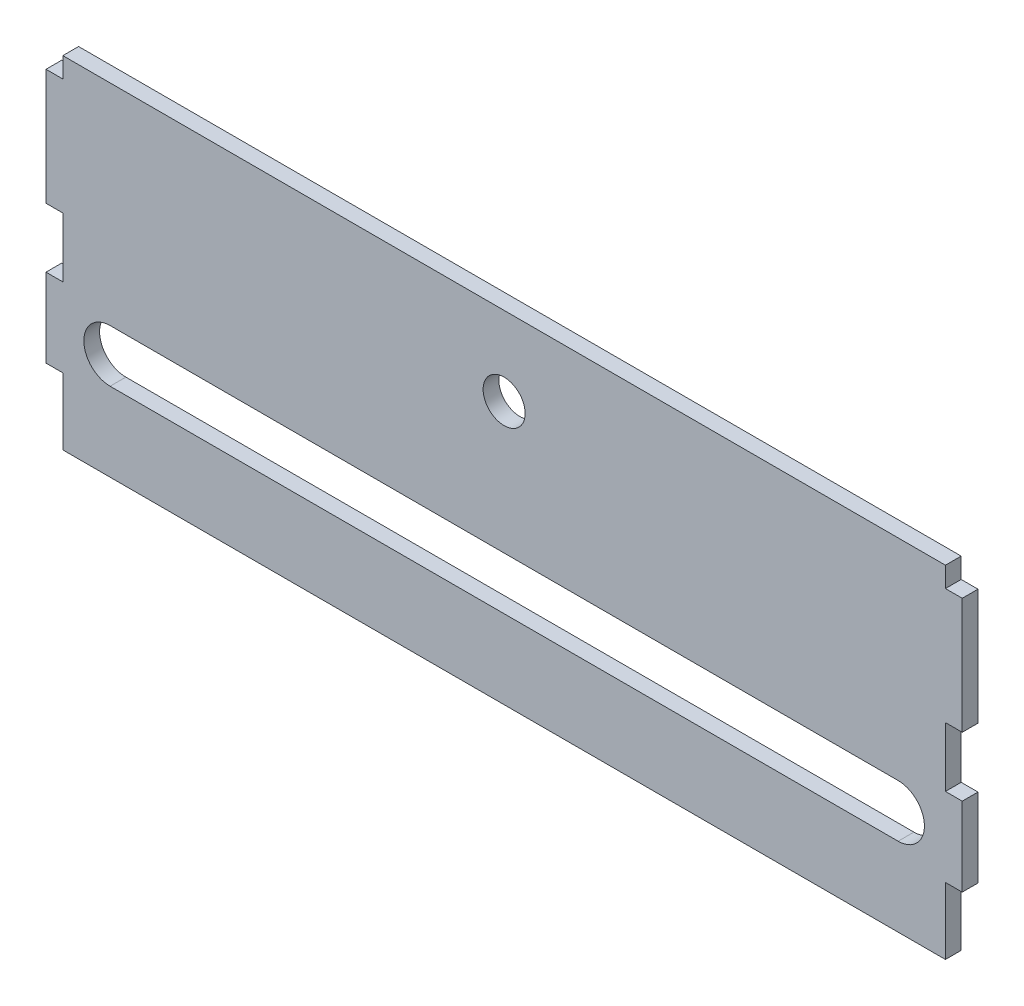
ISO-10303-21;
HEADER;
FILE_DESCRIPTION(('STEP AP214'),'2;1');
FILE_NAME('part.step','',(''),(''),'','','');
FILE_SCHEMA(('AUTOMOTIVE_DESIGN { 1 0 10303 214 1 1 1 1 }'));
ENDSEC;
DATA;
#1=APPLICATION_CONTEXT('core data for automotive mechanical design processes');
#2=APPLICATION_PROTOCOL_DEFINITION('international standard','automotive_design',2000,#1);
#3=PRODUCT_CONTEXT('',#1,'mechanical');
#4=PRODUCT('Part','Part','',(#3));
#5=PRODUCT_RELATED_PRODUCT_CATEGORY('part','',(#4));
#6=PRODUCT_DEFINITION_FORMATION('','',#4);
#7=PRODUCT_DEFINITION_CONTEXT('part definition',#1,'design');
#8=PRODUCT_DEFINITION('design','',#6,#7);
#9=PRODUCT_DEFINITION_SHAPE('','',#8);
#10=(LENGTH_UNIT() NAMED_UNIT(*) SI_UNIT(.MILLI.,.METRE.));
#11=(NAMED_UNIT(*) PLANE_ANGLE_UNIT() SI_UNIT($,.RADIAN.));
#12=(NAMED_UNIT(*) SI_UNIT($,.STERADIAN.) SOLID_ANGLE_UNIT());
#13=UNCERTAINTY_MEASURE_WITH_UNIT(LENGTH_MEASURE(1.E-05),#10,'distance_accuracy_value','');
#14=(GEOMETRIC_REPRESENTATION_CONTEXT(3) GLOBAL_UNCERTAINTY_ASSIGNED_CONTEXT((#13)) GLOBAL_UNIT_ASSIGNED_CONTEXT((#10,
#11,#12)) REPRESENTATION_CONTEXT('',''));
#15=CARTESIAN_POINT('',(0.,0.,0.));
#16=DIRECTION('',(0.,0.,1.));
#17=DIRECTION('',(1.,0.,0.));
#18=AXIS2_PLACEMENT_3D('',#15,#16,#17);
#19=CARTESIAN_POINT('',(0.,0.,3.));
#20=DIRECTION('',(0.,0.,1.));
#21=DIRECTION('',(1.,0.,0.));
#22=AXIS2_PLACEMENT_3D('',#19,#20,#21);
#23=PLANE('',#22);
#24=DIRECTION('',(1.,0.,0.));
#25=VECTOR('',#24,1.);
#26=CARTESIAN_POINT('',(-92.3955288873253,15.,3.));
#27=LINE('',#26,#25);
#28=CARTESIAN_POINT('',(-84.,15.,3.));
#29=VERTEX_POINT('',#28);
#30=CARTESIAN_POINT('',(84.0000000000001,15.,3.));
#31=VERTEX_POINT('',#30);
#32=EDGE_CURVE('E59',#29,#31,#27,.T.);
#33=ORIENTED_EDGE('',*,*,#32,.F.);
#34=DIRECTION('',(0.,-1.,0.));
#35=VECTOR('',#34,1.);
#36=CARTESIAN_POINT('',(-84.,11.1478908984833,3.));
#37=LINE('',#36,#35);
#38=CARTESIAN_POINT('',(-84.,11.1478908984833,3.));
#39=VERTEX_POINT('',#38);
#40=EDGE_CURVE('E215',#29,#39,#37,.T.);
#41=ORIENTED_EDGE('',*,*,#40,.T.);
#42=DIRECTION('',(-1.,0.,0.));
#43=VECTOR('',#42,1.);
#44=CARTESIAN_POINT('',(-84.,11.1478908984833,3.));
#45=LINE('',#44,#43);
#46=CARTESIAN_POINT('',(-87.2,11.1478908984833,3.));
#47=VERTEX_POINT('',#46);
#48=EDGE_CURVE('E224',#39,#47,#45,.T.);
#49=ORIENTED_EDGE('',*,*,#48,.T.);
#50=DIRECTION('',(0.,-1.,0.));
#51=VECTOR('',#50,1.);
#52=CARTESIAN_POINT('',(-87.2,11.1478908984833,3.));
#53=LINE('',#52,#51);
#54=CARTESIAN_POINT('',(-87.2,-10.9453908984831,3.));
#55=VERTEX_POINT('',#54);
#56=EDGE_CURVE('E229',#47,#55,#53,.T.);
#57=ORIENTED_EDGE('',*,*,#56,.T.);
#58=DIRECTION('',(1.,0.,0.));
#59=VECTOR('',#58,1.);
#60=CARTESIAN_POINT('',(-87.2,-10.9453908984831,3.));
#61=LINE('',#60,#59);
#62=CARTESIAN_POINT('',(-84.,-10.9453908984831,3.));
#63=VERTEX_POINT('',#62);
#64=EDGE_CURVE('E240',#55,#63,#61,.T.);
#65=ORIENTED_EDGE('',*,*,#64,.T.);
#66=DIRECTION('',(0.,-1.,0.));
#67=VECTOR('',#66,1.);
#68=CARTESIAN_POINT('',(-84.,-22.2953908984831,3.));
#69=LINE('',#68,#67);
#70=CARTESIAN_POINT('',(-84.,-22.2953908984831,3.));
#71=VERTEX_POINT('',#70);
#72=EDGE_CURVE('E243',#63,#71,#69,.T.);
#73=ORIENTED_EDGE('',*,*,#72,.T.);
#74=DIRECTION('',(-1.,0.,0.));
#75=VECTOR('',#74,1.);
#76=CARTESIAN_POINT('',(-87.2,-22.2953908984831,3.));
#77=LINE('',#76,#75);
#78=CARTESIAN_POINT('',(-87.2,-22.2953908984831,3.));
#79=VERTEX_POINT('',#78);
#80=EDGE_CURVE('E246',#71,#79,#77,.T.);
#81=ORIENTED_EDGE('',*,*,#80,.T.);
#82=DIRECTION('',(0.,-1.,0.));
#83=VECTOR('',#82,1.);
#84=CARTESIAN_POINT('',(-87.2,-37.2953908984831,3.));
#85=LINE('',#84,#83);
#86=CARTESIAN_POINT('',(-87.2,-37.2953908984831,3.));
#87=VERTEX_POINT('',#86);
#88=EDGE_CURVE('E249',#79,#87,#85,.T.);
#89=ORIENTED_EDGE('',*,*,#88,.T.);
#90=DIRECTION('',(1.,0.,0.));
#91=VECTOR('',#90,1.);
#92=CARTESIAN_POINT('',(-84.,-37.2953908984831,3.));
#93=LINE('',#92,#91);
#94=CARTESIAN_POINT('',(-84.,-37.2953908984831,3.));
#95=VERTEX_POINT('',#94);
#96=EDGE_CURVE('E252',#87,#95,#93,.T.);
#97=ORIENTED_EDGE('',*,*,#96,.T.);
#98=DIRECTION('',(0.,-1.,0.));
#99=VECTOR('',#98,1.);
#100=CARTESIAN_POINT('',(-84.,-50.,3.));
#101=LINE('',#100,#99);
#102=CARTESIAN_POINT('',(-84.,-50.,3.));
#103=VERTEX_POINT('',#102);
#104=EDGE_CURVE('E255',#95,#103,#101,.T.);
#105=ORIENTED_EDGE('',*,*,#104,.T.);
#106=DIRECTION('',(1.,0.,0.));
#107=VECTOR('',#106,1.);
#108=CARTESIAN_POINT('',(84.,-50.,3.));
#109=LINE('',#108,#107);
#110=CARTESIAN_POINT('',(84.,-50.,3.));
#111=VERTEX_POINT('',#110);
#112=EDGE_CURVE('E258',#103,#111,#109,.T.);
#113=ORIENTED_EDGE('',*,*,#112,.T.);
#114=DIRECTION('',(0.,1.,0.));
#115=VECTOR('',#114,1.);
#116=CARTESIAN_POINT('',(84.,-50.,3.));
#117=LINE('',#116,#115);
#118=CARTESIAN_POINT('',(84.0000000000001,-37.2953908984831,3.));
#119=VERTEX_POINT('',#118);
#120=EDGE_CURVE('E261',#111,#119,#117,.T.);
#121=ORIENTED_EDGE('',*,*,#120,.T.);
#122=DIRECTION('',(1.,0.,0.));
#123=VECTOR('',#122,1.);
#124=CARTESIAN_POINT('',(84.0000000000001,-37.2953908984831,3.));
#125=LINE('',#124,#123);
#126=CARTESIAN_POINT('',(87.2000000000001,-37.2953908984831,3.));
#127=VERTEX_POINT('',#126);
#128=EDGE_CURVE('E264',#119,#127,#125,.T.);
#129=ORIENTED_EDGE('',*,*,#128,.T.);
#130=DIRECTION('',(0.,1.,0.));
#131=VECTOR('',#130,1.);
#132=CARTESIAN_POINT('',(87.2000000000001,-37.2953908984831,3.));
#133=LINE('',#132,#131);
#134=CARTESIAN_POINT('',(87.2000000000001,-22.2953908984831,3.));
#135=VERTEX_POINT('',#134);
#136=EDGE_CURVE('E267',#127,#135,#133,.T.);
#137=ORIENTED_EDGE('',*,*,#136,.T.);
#138=DIRECTION('',(-1.,0.,0.));
#139=VECTOR('',#138,1.);
#140=CARTESIAN_POINT('',(87.2000000000001,-22.2953908984831,3.));
#141=LINE('',#140,#139);
#142=CARTESIAN_POINT('',(84.0000000000001,-22.2953908984831,3.));
#143=VERTEX_POINT('',#142);
#144=EDGE_CURVE('E270',#135,#143,#141,.T.);
#145=ORIENTED_EDGE('',*,*,#144,.T.);
#146=DIRECTION('',(0.,1.,0.));
#147=VECTOR('',#146,1.);
#148=CARTESIAN_POINT('',(84.0000000000001,-22.2953908984831,3.));
#149=LINE('',#148,#147);
#150=CARTESIAN_POINT('',(84.,-10.945390898483,3.));
#151=VERTEX_POINT('',#150);
#152=EDGE_CURVE('E273',#143,#151,#149,.T.);
#153=ORIENTED_EDGE('',*,*,#152,.T.);
#154=DIRECTION('',(1.,0.,0.));
#155=VECTOR('',#154,1.);
#156=CARTESIAN_POINT('',(87.2,-10.945390898483,3.));
#157=LINE('',#156,#155);
#158=CARTESIAN_POINT('',(87.2,-10.945390898483,3.));
#159=VERTEX_POINT('',#158);
#160=EDGE_CURVE('E276',#151,#159,#157,.T.);
#161=ORIENTED_EDGE('',*,*,#160,.T.);
#162=DIRECTION('',(0.,1.,0.));
#163=VECTOR('',#162,1.);
#164=CARTESIAN_POINT('',(87.2000000000001,11.1478908984833,3.));
#165=LINE('',#164,#163);
#166=CARTESIAN_POINT('',(87.2000000000001,11.1478908984833,3.));
#167=VERTEX_POINT('',#166);
#168=EDGE_CURVE('E279',#159,#167,#165,.T.);
#169=ORIENTED_EDGE('',*,*,#168,.T.);
#170=DIRECTION('',(-1.,0.,0.));
#171=VECTOR('',#170,1.);
#172=CARTESIAN_POINT('',(84.0000000000001,11.1478908984833,3.));
#173=LINE('',#172,#171);
#174=CARTESIAN_POINT('',(84.0000000000001,11.1478908984833,3.));
#175=VERTEX_POINT('',#174);
#176=EDGE_CURVE('E282',#167,#175,#173,.T.);
#177=ORIENTED_EDGE('',*,*,#176,.T.);
#178=DIRECTION('',(0.,1.,0.));
#179=VECTOR('',#178,1.);
#180=CARTESIAN_POINT('',(84.0000000000001,11.1478908984833,3.));
#181=LINE('',#180,#179);
#182=EDGE_CURVE('E218',#175,#31,#181,.T.);
#183=ORIENTED_EDGE('',*,*,#182,.T.);
#184=EDGE_LOOP('',(#33,#41,#49,#57,#65,#73,#81,#89,#97,#105,#113,#121,#129,#137,#145,#153,#161,
#169,#177,#183));
#185=FACE_BOUND('',#184,.T.);
#186=CARTESIAN_POINT('',(0.,0.,3.));
#187=DIRECTION('',(0.,0.,1.));
#188=DIRECTION('',(1.,0.,0.));
#189=AXIS2_PLACEMENT_3D('',#186,#187,#188);
#190=CIRCLE('',#189,4.);
#191=CARTESIAN_POINT('',(4.00000000000001,0.,3.));
#192=VERTEX_POINT('',#191);
#193=EDGE_CURVE('E292',#192,#192,#190,.T.);
#194=ORIENTED_EDGE('',*,*,#193,.F.);
#195=EDGE_LOOP('',(#194));
#196=FACE_BOUND('',#195,.T.);
#197=DIRECTION('',(1.,0.,0.));
#198=VECTOR('',#197,1.);
#199=CARTESIAN_POINT('',(-75.,-35.,3.));
#200=LINE('',#199,#198);
#201=CARTESIAN_POINT('',(-75.,-35.,3.));
#202=VERTEX_POINT('',#201);
#203=CARTESIAN_POINT('',(75.,-35.,3.));
#204=VERTEX_POINT('',#203);
#205=EDGE_CURVE('E505',#202,#204,#200,.T.);
#206=ORIENTED_EDGE('',*,*,#205,.F.);
#207=CARTESIAN_POINT('',(-75.,-30.0000000000001,3.));
#208=DIRECTION('',(0.,0.,1.));
#209=DIRECTION('',(1.,0.,0.));
#210=AXIS2_PLACEMENT_3D('',#207,#208,#209);
#211=CIRCLE('',#210,4.99999999999998);
#212=CARTESIAN_POINT('',(-75.,-25.0000000000001,3.));
#213=VERTEX_POINT('',#212);
#214=EDGE_CURVE('E502',#213,#202,#211,.T.);
#215=ORIENTED_EDGE('',*,*,#214,.F.);
#216=DIRECTION('',(-1.,0.,0.));
#217=VECTOR('',#216,1.);
#218=CARTESIAN_POINT('',(-75.,-25.0000000000001,3.));
#219=LINE('',#218,#217);
#220=CARTESIAN_POINT('',(75.,-25.,3.));
#221=VERTEX_POINT('',#220);
#222=EDGE_CURVE('E512',#221,#213,#219,.T.);
#223=ORIENTED_EDGE('',*,*,#222,.F.);
#224=CARTESIAN_POINT('',(75.,-30.,3.));
#225=DIRECTION('',(0.,0.,1.));
#226=DIRECTION('',(1.,0.,0.));
#227=AXIS2_PLACEMENT_3D('',#224,#225,#226);
#228=CIRCLE('',#227,4.99999999999998);
#229=EDGE_CURVE('E509',#204,#221,#228,.T.);
#230=ORIENTED_EDGE('',*,*,#229,.F.);
#231=EDGE_LOOP('',(#206,#215,#223,#230));
#232=FACE_BOUND('',#231,.T.);
#233=ADVANCED_FACE('F43',(#185,#196,#232),#23,.T.);
#234=CARTESIAN_POINT('',(0.,0.,0.));
#235=DIRECTION('',(0.,0.,1.));
#236=DIRECTION('',(1.,0.,0.));
#237=AXIS2_PLACEMENT_3D('',#234,#235,#236);
#238=PLANE('',#237);
#239=CARTESIAN_POINT('',(-75.,-30.0000000000001,0.));
#240=DIRECTION('',(0.,0.,1.));
#241=DIRECTION('',(1.,0.,0.));
#242=AXIS2_PLACEMENT_3D('',#239,#240,#241);
#243=CIRCLE('',#242,4.99999999999998);
#244=CARTESIAN_POINT('',(-75.,-25.0000000000001,0.));
#245=VERTEX_POINT('',#244);
#246=CARTESIAN_POINT('',(-75.,-35.,0.));
#247=VERTEX_POINT('',#246);
#248=EDGE_CURVE('E210',#245,#247,#243,.T.);
#249=ORIENTED_EDGE('',*,*,#248,.T.);
#250=DIRECTION('',(1.,0.,0.));
#251=VECTOR('',#250,1.);
#252=CARTESIAN_POINT('',(-75.,-35.,0.));
#253=LINE('',#252,#251);
#254=CARTESIAN_POINT('',(75.,-35.,0.));
#255=VERTEX_POINT('',#254);
#256=EDGE_CURVE('E519',#247,#255,#253,.T.);
#257=ORIENTED_EDGE('',*,*,#256,.T.);
#258=CARTESIAN_POINT('',(75.,-30.,0.));
#259=DIRECTION('',(0.,0.,1.));
#260=DIRECTION('',(1.,0.,0.));
#261=AXIS2_PLACEMENT_3D('',#258,#259,#260);
#262=CIRCLE('',#261,4.99999999999998);
#263=CARTESIAN_POINT('',(75.,-25.,0.));
#264=VERTEX_POINT('',#263);
#265=EDGE_CURVE('E523',#255,#264,#262,.T.);
#266=ORIENTED_EDGE('',*,*,#265,.T.);
#267=DIRECTION('',(-1.,0.,0.));
#268=VECTOR('',#267,1.);
#269=CARTESIAN_POINT('',(-75.,-25.0000000000001,0.));
#270=LINE('',#269,#268);
#271=EDGE_CURVE('E506',#264,#245,#270,.T.);
#272=ORIENTED_EDGE('',*,*,#271,.T.);
#273=EDGE_LOOP('',(#249,#257,#266,#272));
#274=FACE_BOUND('',#273,.T.);
#275=DIRECTION('',(0.,-1.,0.));
#276=VECTOR('',#275,1.);
#277=CARTESIAN_POINT('',(-84.,11.1478908984833,0.));
#278=LINE('',#277,#276);
#279=CARTESIAN_POINT('',(-84.,15.,0.));
#280=VERTEX_POINT('',#279);
#281=CARTESIAN_POINT('',(-84.,11.1478908984833,0.));
#282=VERTEX_POINT('',#281);
#283=EDGE_CURVE('E288',#280,#282,#278,.T.);
#284=ORIENTED_EDGE('',*,*,#283,.F.);
#285=DIRECTION('',(1.,0.,0.));
#286=VECTOR('',#285,1.);
#287=CARTESIAN_POINT('',(-92.3955288873253,15.,0.));
#288=LINE('',#287,#286);
#289=CARTESIAN_POINT('',(84.0000000000001,15.,0.));
#290=VERTEX_POINT('',#289);
#291=EDGE_CURVE('E205',#280,#290,#288,.T.);
#292=ORIENTED_EDGE('',*,*,#291,.T.);
#293=DIRECTION('',(0.,1.,0.));
#294=VECTOR('',#293,1.);
#295=CARTESIAN_POINT('',(84.0000000000001,11.1478908984833,0.));
#296=LINE('',#295,#294);
#297=CARTESIAN_POINT('',(84.0000000000001,11.1478908984833,0.));
#298=VERTEX_POINT('',#297);
#299=EDGE_CURVE('E225',#298,#290,#296,.T.);
#300=ORIENTED_EDGE('',*,*,#299,.F.);
#301=DIRECTION('',(-1.,0.,0.));
#302=VECTOR('',#301,1.);
#303=CARTESIAN_POINT('',(84.0000000000001,11.1478908984833,0.));
#304=LINE('',#303,#302);
#305=CARTESIAN_POINT('',(87.2000000000001,11.1478908984833,0.));
#306=VERTEX_POINT('',#305);
#307=EDGE_CURVE('E232',#306,#298,#304,.T.);
#308=ORIENTED_EDGE('',*,*,#307,.F.);
#309=DIRECTION('',(0.,1.,0.));
#310=VECTOR('',#309,1.);
#311=CARTESIAN_POINT('',(87.2000000000001,11.1478908984833,0.));
#312=LINE('',#311,#310);
#313=CARTESIAN_POINT('',(87.2,-10.945390898483,0.));
#314=VERTEX_POINT('',#313);
#315=EDGE_CURVE('E337',#314,#306,#312,.T.);
#316=ORIENTED_EDGE('',*,*,#315,.F.);
#317=DIRECTION('',(1.,0.,0.));
#318=VECTOR('',#317,1.);
#319=CARTESIAN_POINT('',(87.2,-10.945390898483,0.));
#320=LINE('',#319,#318);
#321=CARTESIAN_POINT('',(84.,-10.945390898483,0.));
#322=VERTEX_POINT('',#321);
#323=EDGE_CURVE('E334',#322,#314,#320,.T.);
#324=ORIENTED_EDGE('',*,*,#323,.F.);
#325=DIRECTION('',(0.,1.,0.));
#326=VECTOR('',#325,1.);
#327=CARTESIAN_POINT('',(84.0000000000001,-22.2953908984831,0.));
#328=LINE('',#327,#326);
#329=CARTESIAN_POINT('',(84.0000000000001,-22.2953908984831,0.));
#330=VERTEX_POINT('',#329);
#331=EDGE_CURVE('E331',#330,#322,#328,.T.);
#332=ORIENTED_EDGE('',*,*,#331,.F.);
#333=DIRECTION('',(-1.,0.,0.));
#334=VECTOR('',#333,1.);
#335=CARTESIAN_POINT('',(87.2000000000001,-22.2953908984831,0.));
#336=LINE('',#335,#334);
#337=CARTESIAN_POINT('',(87.2000000000001,-22.2953908984831,0.));
#338=VERTEX_POINT('',#337);
#339=EDGE_CURVE('E328',#338,#330,#336,.T.);
#340=ORIENTED_EDGE('',*,*,#339,.F.);
#341=DIRECTION('',(0.,1.,0.));
#342=VECTOR('',#341,1.);
#343=CARTESIAN_POINT('',(87.2000000000001,-37.2953908984831,0.));
#344=LINE('',#343,#342);
#345=CARTESIAN_POINT('',(87.2000000000001,-37.2953908984831,0.));
#346=VERTEX_POINT('',#345);
#347=EDGE_CURVE('E325',#346,#338,#344,.T.);
#348=ORIENTED_EDGE('',*,*,#347,.F.);
#349=DIRECTION('',(1.,0.,0.));
#350=VECTOR('',#349,1.);
#351=CARTESIAN_POINT('',(84.0000000000001,-37.2953908984831,0.));
#352=LINE('',#351,#350);
#353=CARTESIAN_POINT('',(84.0000000000001,-37.2953908984831,0.));
#354=VERTEX_POINT('',#353);
#355=EDGE_CURVE('E322',#354,#346,#352,.T.);
#356=ORIENTED_EDGE('',*,*,#355,.F.);
#357=DIRECTION('',(0.,1.,0.));
#358=VECTOR('',#357,1.);
#359=CARTESIAN_POINT('',(84.,-50.,0.));
#360=LINE('',#359,#358);
#361=CARTESIAN_POINT('',(84.,-50.,0.));
#362=VERTEX_POINT('',#361);
#363=EDGE_CURVE('E319',#362,#354,#360,.T.);
#364=ORIENTED_EDGE('',*,*,#363,.F.);
#365=DIRECTION('',(1.,0.,0.));
#366=VECTOR('',#365,1.);
#367=CARTESIAN_POINT('',(84.,-50.,0.));
#368=LINE('',#367,#366);
#369=CARTESIAN_POINT('',(-84.,-50.,0.));
#370=VERTEX_POINT('',#369);
#371=EDGE_CURVE('E316',#370,#362,#368,.T.);
#372=ORIENTED_EDGE('',*,*,#371,.F.);
#373=DIRECTION('',(0.,-1.,0.));
#374=VECTOR('',#373,1.);
#375=CARTESIAN_POINT('',(-84.,-50.,0.));
#376=LINE('',#375,#374);
#377=CARTESIAN_POINT('',(-84.,-37.2953908984831,0.));
#378=VERTEX_POINT('',#377);
#379=EDGE_CURVE('E313',#378,#370,#376,.T.);
#380=ORIENTED_EDGE('',*,*,#379,.F.);
#381=DIRECTION('',(1.,0.,0.));
#382=VECTOR('',#381,1.);
#383=CARTESIAN_POINT('',(-84.,-37.2953908984831,0.));
#384=LINE('',#383,#382);
#385=CARTESIAN_POINT('',(-87.2,-37.2953908984831,0.));
#386=VERTEX_POINT('',#385);
#387=EDGE_CURVE('E310',#386,#378,#384,.T.);
#388=ORIENTED_EDGE('',*,*,#387,.F.);
#389=DIRECTION('',(0.,-1.,0.));
#390=VECTOR('',#389,1.);
#391=CARTESIAN_POINT('',(-87.2,-37.2953908984831,0.));
#392=LINE('',#391,#390);
#393=CARTESIAN_POINT('',(-87.2,-22.2953908984831,0.));
#394=VERTEX_POINT('',#393);
#395=EDGE_CURVE('E307',#394,#386,#392,.T.);
#396=ORIENTED_EDGE('',*,*,#395,.F.);
#397=DIRECTION('',(-1.,0.,0.));
#398=VECTOR('',#397,1.);
#399=CARTESIAN_POINT('',(-87.2,-22.2953908984831,0.));
#400=LINE('',#399,#398);
#401=CARTESIAN_POINT('',(-84.,-22.2953908984831,0.));
#402=VERTEX_POINT('',#401);
#403=EDGE_CURVE('E304',#402,#394,#400,.T.);
#404=ORIENTED_EDGE('',*,*,#403,.F.);
#405=DIRECTION('',(0.,-1.,0.));
#406=VECTOR('',#405,1.);
#407=CARTESIAN_POINT('',(-84.,-22.2953908984831,0.));
#408=LINE('',#407,#406);
#409=CARTESIAN_POINT('',(-84.,-10.9453908984831,0.));
#410=VERTEX_POINT('',#409);
#411=EDGE_CURVE('E301',#410,#402,#408,.T.);
#412=ORIENTED_EDGE('',*,*,#411,.F.);
#413=DIRECTION('',(1.,0.,0.));
#414=VECTOR('',#413,1.);
#415=CARTESIAN_POINT('',(-87.2,-10.9453908984831,0.));
#416=LINE('',#415,#414);
#417=CARTESIAN_POINT('',(-87.2,-10.9453908984831,0.));
#418=VERTEX_POINT('',#417);
#419=EDGE_CURVE('E298',#418,#410,#416,.T.);
#420=ORIENTED_EDGE('',*,*,#419,.F.);
#421=DIRECTION('',(0.,-1.,0.));
#422=VECTOR('',#421,1.);
#423=CARTESIAN_POINT('',(-87.2,11.1478908984833,0.));
#424=LINE('',#423,#422);
#425=CARTESIAN_POINT('',(-87.2,11.1478908984833,0.));
#426=VERTEX_POINT('',#425);
#427=EDGE_CURVE('E295',#426,#418,#424,.T.);
#428=ORIENTED_EDGE('',*,*,#427,.F.);
#429=DIRECTION('',(-1.,0.,0.));
#430=VECTOR('',#429,1.);
#431=CARTESIAN_POINT('',(-84.,11.1478908984833,0.));
#432=LINE('',#431,#430);
#433=EDGE_CURVE('E291',#282,#426,#432,.T.);
#434=ORIENTED_EDGE('',*,*,#433,.F.);
#435=EDGE_LOOP('',(#284,#292,#300,#308,#316,#324,#332,#340,#348,#356,#364,#372,#380,#388,#396,
#404,#412,#420,#428,#434));
#436=FACE_BOUND('',#435,.T.);
#437=CARTESIAN_POINT('',(0.,0.,0.));
#438=DIRECTION('',(0.,0.,1.));
#439=DIRECTION('',(1.,0.,0.));
#440=AXIS2_PLACEMENT_3D('',#437,#438,#439);
#441=CIRCLE('',#440,4.);
#442=CARTESIAN_POINT('',(4.00000000000001,0.,0.));
#443=VERTEX_POINT('',#442);
#444=EDGE_CURVE('E235',#443,#443,#441,.T.);
#445=ORIENTED_EDGE('',*,*,#444,.T.);
#446=EDGE_LOOP('',(#445));
#447=FACE_BOUND('',#446,.T.);
#448=ADVANCED_FACE('F415',(#274,#436,#447),#238,.F.);
#449=CARTESIAN_POINT('',(-84.,11.1478908984833,3.));
#450=DIRECTION('',(1.,0.,0.));
#451=DIRECTION('',(0.,0.,-1.));
#452=AXIS2_PLACEMENT_3D('',#449,#450,#451);
#453=PLANE('',#452);
#454=ORIENTED_EDGE('',*,*,#40,.F.);
#455=DIRECTION('',(0.,0.,-1.));
#456=VECTOR('',#455,1.);
#457=CARTESIAN_POINT('',(-84.,15.,3.));
#458=LINE('',#457,#456);
#459=EDGE_CURVE('E202',#29,#280,#458,.T.);
#460=ORIENTED_EDGE('',*,*,#459,.T.);
#461=ORIENTED_EDGE('',*,*,#283,.T.);
#462=DIRECTION('',(0.,0.,-1.));
#463=VECTOR('',#462,1.);
#464=CARTESIAN_POINT('',(-84.,11.1478908984833,3.));
#465=LINE('',#464,#463);
#466=EDGE_CURVE('E52',#39,#282,#465,.T.);
#467=ORIENTED_EDGE('',*,*,#466,.F.);
#468=EDGE_LOOP('',(#454,#460,#461,#467));
#469=FACE_BOUND('',#468,.T.);
#470=ADVANCED_FACE('F45',(#469),#453,.F.);
#471=CARTESIAN_POINT('',(-84.,11.1478908984833,3.));
#472=DIRECTION('',(0.,-1.,0.));
#473=DIRECTION('',(0.,0.,-1.));
#474=AXIS2_PLACEMENT_3D('',#471,#472,#473);
#475=PLANE('',#474);
#476=ORIENTED_EDGE('',*,*,#433,.T.);
#477=DIRECTION('',(0.,0.,-1.));
#478=VECTOR('',#477,1.);
#479=CARTESIAN_POINT('',(-87.2,11.1478908984833,3.));
#480=LINE('',#479,#478);
#481=EDGE_CURVE('E405',#47,#426,#480,.T.);
#482=ORIENTED_EDGE('',*,*,#481,.F.);
#483=ORIENTED_EDGE('',*,*,#48,.F.);
#484=ORIENTED_EDGE('',*,*,#466,.T.);
#485=EDGE_LOOP('',(#476,#482,#483,#484));
#486=FACE_BOUND('',#485,.T.);
#487=ADVANCED_FACE('F411',(#486),#475,.F.);
#488=CARTESIAN_POINT('',(-87.2,11.1478908984833,3.));
#489=DIRECTION('',(1.,0.,0.));
#490=DIRECTION('',(0.,0.,-1.));
#491=AXIS2_PLACEMENT_3D('',#488,#489,#490);
#492=PLANE('',#491);
#493=ORIENTED_EDGE('',*,*,#427,.T.);
#494=DIRECTION('',(0.,0.,-1.));
#495=VECTOR('',#494,1.);
#496=CARTESIAN_POINT('',(-87.2,-10.9453908984831,3.));
#497=LINE('',#496,#495);
#498=EDGE_CURVE('E401',#55,#418,#497,.T.);
#499=ORIENTED_EDGE('',*,*,#498,.F.);
#500=ORIENTED_EDGE('',*,*,#56,.F.);
#501=ORIENTED_EDGE('',*,*,#481,.T.);
#502=EDGE_LOOP('',(#493,#499,#500,#501));
#503=FACE_BOUND('',#502,.T.);
#504=ADVANCED_FACE('F421',(#503),#492,.F.);
#505=CARTESIAN_POINT('',(-87.2,-10.9453908984831,3.));
#506=DIRECTION('',(0.,1.,0.));
#507=DIRECTION('',(0.,0.,1.));
#508=AXIS2_PLACEMENT_3D('',#505,#506,#507);
#509=PLANE('',#508);
#510=ORIENTED_EDGE('',*,*,#419,.T.);
#511=DIRECTION('',(0.,0.,-1.));
#512=VECTOR('',#511,1.);
#513=CARTESIAN_POINT('',(-84.,-10.9453908984831,3.));
#514=LINE('',#513,#512);
#515=EDGE_CURVE('E397',#63,#410,#514,.T.);
#516=ORIENTED_EDGE('',*,*,#515,.F.);
#517=ORIENTED_EDGE('',*,*,#64,.F.);
#518=ORIENTED_EDGE('',*,*,#498,.T.);
#519=EDGE_LOOP('',(#510,#516,#517,#518));
#520=FACE_BOUND('',#519,.T.);
#521=ADVANCED_FACE('F425',(#520),#509,.F.);
#522=CARTESIAN_POINT('',(-84.,-22.2953908984831,3.));
#523=DIRECTION('',(1.,0.,0.));
#524=DIRECTION('',(0.,0.,-1.));
#525=AXIS2_PLACEMENT_3D('',#522,#523,#524);
#526=PLANE('',#525);
#527=ORIENTED_EDGE('',*,*,#411,.T.);
#528=DIRECTION('',(0.,0.,-1.));
#529=VECTOR('',#528,1.);
#530=CARTESIAN_POINT('',(-84.,-22.2953908984831,3.));
#531=LINE('',#530,#529);
#532=EDGE_CURVE('E393',#71,#402,#531,.T.);
#533=ORIENTED_EDGE('',*,*,#532,.F.);
#534=ORIENTED_EDGE('',*,*,#72,.F.);
#535=ORIENTED_EDGE('',*,*,#515,.T.);
#536=EDGE_LOOP('',(#527,#533,#534,#535));
#537=FACE_BOUND('',#536,.T.);
#538=ADVANCED_FACE('F432',(#537),#526,.F.);
#539=CARTESIAN_POINT('',(-87.2,-22.2953908984831,3.));
#540=DIRECTION('',(0.,-1.,0.));
#541=DIRECTION('',(0.,0.,-1.));
#542=AXIS2_PLACEMENT_3D('',#539,#540,#541);
#543=PLANE('',#542);
#544=ORIENTED_EDGE('',*,*,#403,.T.);
#545=DIRECTION('',(0.,0.,-1.));
#546=VECTOR('',#545,1.);
#547=CARTESIAN_POINT('',(-87.2,-22.2953908984831,3.));
#548=LINE('',#547,#546);
#549=EDGE_CURVE('E389',#79,#394,#548,.T.);
#550=ORIENTED_EDGE('',*,*,#549,.F.);
#551=ORIENTED_EDGE('',*,*,#80,.F.);
#552=ORIENTED_EDGE('',*,*,#532,.T.);
#553=EDGE_LOOP('',(#544,#550,#551,#552));
#554=FACE_BOUND('',#553,.T.);
#555=ADVANCED_FACE('F435',(#554),#543,.F.);
#556=CARTESIAN_POINT('',(-87.2,-37.2953908984831,3.));
#557=DIRECTION('',(1.,0.,0.));
#558=DIRECTION('',(0.,1.,0.));
#559=AXIS2_PLACEMENT_3D('',#556,#557,#558);
#560=PLANE('',#559);
#561=ORIENTED_EDGE('',*,*,#395,.T.);
#562=DIRECTION('',(0.,0.,-1.));
#563=VECTOR('',#562,1.);
#564=CARTESIAN_POINT('',(-87.2,-37.2953908984831,3.));
#565=LINE('',#564,#563);
#566=EDGE_CURVE('E385',#87,#386,#565,.T.);
#567=ORIENTED_EDGE('',*,*,#566,.F.);
#568=ORIENTED_EDGE('',*,*,#88,.F.);
#569=ORIENTED_EDGE('',*,*,#549,.T.);
#570=EDGE_LOOP('',(#561,#567,#568,#569));
#571=FACE_BOUND('',#570,.T.);
#572=ADVANCED_FACE('F440',(#571),#560,.F.);
#573=CARTESIAN_POINT('',(-84.,-37.2953908984831,3.));
#574=DIRECTION('',(0.,1.,0.));
#575=DIRECTION('',(-1.,0.,0.));
#576=AXIS2_PLACEMENT_3D('',#573,#574,#575);
#577=PLANE('',#576);
#578=ORIENTED_EDGE('',*,*,#387,.T.);
#579=DIRECTION('',(0.,0.,-1.));
#580=VECTOR('',#579,1.);
#581=CARTESIAN_POINT('',(-84.,-37.2953908984831,3.));
#582=LINE('',#581,#580);
#583=EDGE_CURVE('E381',#95,#378,#582,.T.);
#584=ORIENTED_EDGE('',*,*,#583,.F.);
#585=ORIENTED_EDGE('',*,*,#96,.F.);
#586=ORIENTED_EDGE('',*,*,#566,.T.);
#587=EDGE_LOOP('',(#578,#584,#585,#586));
#588=FACE_BOUND('',#587,.T.);
#589=ADVANCED_FACE('F446',(#588),#577,.F.);
#590=CARTESIAN_POINT('',(-84.,-50.,3.));
#591=DIRECTION('',(1.,0.,0.));
#592=DIRECTION('',(0.,1.,0.));
#593=AXIS2_PLACEMENT_3D('',#590,#591,#592);
#594=PLANE('',#593);
#595=ORIENTED_EDGE('',*,*,#379,.T.);
#596=DIRECTION('',(0.,0.,-1.));
#597=VECTOR('',#596,1.);
#598=CARTESIAN_POINT('',(-84.,-50.,3.));
#599=LINE('',#598,#597);
#600=EDGE_CURVE('E377',#103,#370,#599,.T.);
#601=ORIENTED_EDGE('',*,*,#600,.F.);
#602=ORIENTED_EDGE('',*,*,#104,.F.);
#603=ORIENTED_EDGE('',*,*,#583,.T.);
#604=EDGE_LOOP('',(#595,#601,#602,#603));
#605=FACE_BOUND('',#604,.T.);
#606=ADVANCED_FACE('F450',(#605),#594,.F.);
#607=CARTESIAN_POINT('',(84.,-50.,3.));
#608=DIRECTION('',(0.,1.,0.));
#609=DIRECTION('',(0.,0.,1.));
#610=AXIS2_PLACEMENT_3D('',#607,#608,#609);
#611=PLANE('',#610);
#612=ORIENTED_EDGE('',*,*,#371,.T.);
#613=DIRECTION('',(0.,0.,-1.));
#614=VECTOR('',#613,1.);
#615=CARTESIAN_POINT('',(84.,-50.,3.));
#616=LINE('',#615,#614);
#617=EDGE_CURVE('E373',#111,#362,#616,.T.);
#618=ORIENTED_EDGE('',*,*,#617,.F.);
#619=ORIENTED_EDGE('',*,*,#112,.F.);
#620=ORIENTED_EDGE('',*,*,#600,.T.);
#621=EDGE_LOOP('',(#612,#618,#619,#620));
#622=FACE_BOUND('',#621,.T.);
#623=ADVANCED_FACE('F455',(#622),#611,.F.);
#624=CARTESIAN_POINT('',(84.,-50.,3.));
#625=DIRECTION('',(-1.,0.,0.));
#626=DIRECTION('',(0.,-1.,0.));
#627=AXIS2_PLACEMENT_3D('',#624,#625,#626);
#628=PLANE('',#627);
#629=ORIENTED_EDGE('',*,*,#363,.T.);
#630=DIRECTION('',(0.,0.,-1.));
#631=VECTOR('',#630,1.);
#632=CARTESIAN_POINT('',(84.0000000000001,-37.2953908984831,3.));
#633=LINE('',#632,#631);
#634=EDGE_CURVE('E369',#119,#354,#633,.T.);
#635=ORIENTED_EDGE('',*,*,#634,.F.);
#636=ORIENTED_EDGE('',*,*,#120,.F.);
#637=ORIENTED_EDGE('',*,*,#617,.T.);
#638=EDGE_LOOP('',(#629,#635,#636,#637));
#639=FACE_BOUND('',#638,.T.);
#640=ADVANCED_FACE('F461',(#639),#628,.F.);
#641=CARTESIAN_POINT('',(84.0000000000001,-37.2953908984831,3.));
#642=DIRECTION('',(0.,1.,0.));
#643=DIRECTION('',(-1.,0.,0.));
#644=AXIS2_PLACEMENT_3D('',#641,#642,#643);
#645=PLANE('',#644);
#646=ORIENTED_EDGE('',*,*,#355,.T.);
#647=DIRECTION('',(0.,0.,-1.));
#648=VECTOR('',#647,1.);
#649=CARTESIAN_POINT('',(87.2000000000001,-37.2953908984831,3.));
#650=LINE('',#649,#648);
#651=EDGE_CURVE('E365',#127,#346,#650,.T.);
#652=ORIENTED_EDGE('',*,*,#651,.F.);
#653=ORIENTED_EDGE('',*,*,#128,.F.);
#654=ORIENTED_EDGE('',*,*,#634,.T.);
#655=EDGE_LOOP('',(#646,#652,#653,#654));
#656=FACE_BOUND('',#655,.T.);
#657=ADVANCED_FACE('F465',(#656),#645,.F.);
#658=CARTESIAN_POINT('',(87.2000000000001,-37.2953908984831,3.));
#659=DIRECTION('',(-1.,0.,0.));
#660=DIRECTION('',(0.,-1.,0.));
#661=AXIS2_PLACEMENT_3D('',#658,#659,#660);
#662=PLANE('',#661);
#663=ORIENTED_EDGE('',*,*,#347,.T.);
#664=DIRECTION('',(0.,0.,-1.));
#665=VECTOR('',#664,1.);
#666=CARTESIAN_POINT('',(87.2000000000001,-22.2953908984831,3.));
#667=LINE('',#666,#665);
#668=EDGE_CURVE('E361',#135,#338,#667,.T.);
#669=ORIENTED_EDGE('',*,*,#668,.F.);
#670=ORIENTED_EDGE('',*,*,#136,.F.);
#671=ORIENTED_EDGE('',*,*,#651,.T.);
#672=EDGE_LOOP('',(#663,#669,#670,#671));
#673=FACE_BOUND('',#672,.T.);
#674=ADVANCED_FACE('F470',(#673),#662,.F.);
#675=CARTESIAN_POINT('',(87.2000000000001,-22.2953908984831,3.));
#676=DIRECTION('',(0.,-1.,0.));
#677=DIRECTION('',(0.,0.,-1.));
#678=AXIS2_PLACEMENT_3D('',#675,#676,#677);
#679=PLANE('',#678);
#680=ORIENTED_EDGE('',*,*,#339,.T.);
#681=DIRECTION('',(0.,0.,-1.));
#682=VECTOR('',#681,1.);
#683=CARTESIAN_POINT('',(84.0000000000001,-22.2953908984831,3.));
#684=LINE('',#683,#682);
#685=EDGE_CURVE('E357',#143,#330,#684,.T.);
#686=ORIENTED_EDGE('',*,*,#685,.F.);
#687=ORIENTED_EDGE('',*,*,#144,.F.);
#688=ORIENTED_EDGE('',*,*,#668,.T.);
#689=EDGE_LOOP('',(#680,#686,#687,#688));
#690=FACE_BOUND('',#689,.T.);
#691=ADVANCED_FACE('F476',(#690),#679,.F.);
#692=CARTESIAN_POINT('',(84.0000000000001,-22.2953908984831,3.));
#693=DIRECTION('',(-1.,0.,0.));
#694=DIRECTION('',(0.,-1.,0.));
#695=AXIS2_PLACEMENT_3D('',#692,#693,#694);
#696=PLANE('',#695);
#697=ORIENTED_EDGE('',*,*,#331,.T.);
#698=DIRECTION('',(0.,0.,-1.));
#699=VECTOR('',#698,1.);
#700=CARTESIAN_POINT('',(84.,-10.945390898483,3.));
#701=LINE('',#700,#699);
#702=EDGE_CURVE('E353',#151,#322,#701,.T.);
#703=ORIENTED_EDGE('',*,*,#702,.F.);
#704=ORIENTED_EDGE('',*,*,#152,.F.);
#705=ORIENTED_EDGE('',*,*,#685,.T.);
#706=EDGE_LOOP('',(#697,#703,#704,#705));
#707=FACE_BOUND('',#706,.T.);
#708=ADVANCED_FACE('F480',(#707),#696,.F.);
#709=CARTESIAN_POINT('',(87.2,-10.945390898483,3.));
#710=DIRECTION('',(0.,1.,0.));
#711=DIRECTION('',(0.,0.,1.));
#712=AXIS2_PLACEMENT_3D('',#709,#710,#711);
#713=PLANE('',#712);
#714=ORIENTED_EDGE('',*,*,#323,.T.);
#715=DIRECTION('',(0.,0.,-1.));
#716=VECTOR('',#715,1.);
#717=CARTESIAN_POINT('',(87.2,-10.945390898483,3.));
#718=LINE('',#717,#716);
#719=EDGE_CURVE('E349',#159,#314,#718,.T.);
#720=ORIENTED_EDGE('',*,*,#719,.F.);
#721=ORIENTED_EDGE('',*,*,#160,.F.);
#722=ORIENTED_EDGE('',*,*,#702,.T.);
#723=EDGE_LOOP('',(#714,#720,#721,#722));
#724=FACE_BOUND('',#723,.T.);
#725=ADVANCED_FACE('F485',(#724),#713,.F.);
#726=CARTESIAN_POINT('',(87.2000000000001,11.1478908984833,3.));
#727=DIRECTION('',(-1.,0.,0.));
#728=DIRECTION('',(0.,-1.,0.));
#729=AXIS2_PLACEMENT_3D('',#726,#727,#728);
#730=PLANE('',#729);
#731=ORIENTED_EDGE('',*,*,#315,.T.);
#732=DIRECTION('',(0.,0.,-1.));
#733=VECTOR('',#732,1.);
#734=CARTESIAN_POINT('',(87.2000000000001,11.1478908984833,3.));
#735=LINE('',#734,#733);
#736=EDGE_CURVE('E345',#167,#306,#735,.T.);
#737=ORIENTED_EDGE('',*,*,#736,.F.);
#738=ORIENTED_EDGE('',*,*,#168,.F.);
#739=ORIENTED_EDGE('',*,*,#719,.T.);
#740=EDGE_LOOP('',(#731,#737,#738,#739));
#741=FACE_BOUND('',#740,.T.);
#742=ADVANCED_FACE('F491',(#741),#730,.F.);
#743=CARTESIAN_POINT('',(84.0000000000001,11.1478908984833,3.));
#744=DIRECTION('',(0.,-1.,0.));
#745=DIRECTION('',(0.,0.,-1.));
#746=AXIS2_PLACEMENT_3D('',#743,#744,#745);
#747=PLANE('',#746);
#748=ORIENTED_EDGE('',*,*,#307,.T.);
#749=DIRECTION('',(0.,0.,-1.));
#750=VECTOR('',#749,1.);
#751=CARTESIAN_POINT('',(84.0000000000001,11.1478908984833,3.));
#752=LINE('',#751,#750);
#753=EDGE_CURVE('E287',#175,#298,#752,.T.);
#754=ORIENTED_EDGE('',*,*,#753,.F.);
#755=ORIENTED_EDGE('',*,*,#176,.F.);
#756=ORIENTED_EDGE('',*,*,#736,.T.);
#757=EDGE_LOOP('',(#748,#754,#755,#756));
#758=FACE_BOUND('',#757,.T.);
#759=ADVANCED_FACE('F495',(#758),#747,.F.);
#760=CARTESIAN_POINT('',(84.0000000000001,11.1478908984833,3.));
#761=DIRECTION('',(-1.,0.,0.));
#762=DIRECTION('',(0.,0.,1.));
#763=AXIS2_PLACEMENT_3D('',#760,#761,#762);
#764=PLANE('',#763);
#765=ORIENTED_EDGE('',*,*,#299,.T.);
#766=DIRECTION('',(0.,0.,1.));
#767=VECTOR('',#766,1.);
#768=CARTESIAN_POINT('',(84.0000000000001,15.,3.));
#769=LINE('',#768,#767);
#770=EDGE_CURVE('E11',#290,#31,#769,.T.);
#771=ORIENTED_EDGE('',*,*,#770,.T.);
#772=ORIENTED_EDGE('',*,*,#182,.F.);
#773=ORIENTED_EDGE('',*,*,#753,.T.);
#774=EDGE_LOOP('',(#765,#771,#772,#773));
#775=FACE_BOUND('',#774,.T.);
#776=ADVANCED_FACE('F498',(#775),#764,.F.);
#777=CARTESIAN_POINT('',(0.,0.,3.));
#778=DIRECTION('',(0.,0.,-1.));
#779=DIRECTION('',(-1.,0.,0.));
#780=AXIS2_PLACEMENT_3D('',#777,#778,#779);
#781=CYLINDRICAL_SURFACE('',#780,4.);
#782=ORIENTED_EDGE('',*,*,#193,.T.);
#783=EDGE_LOOP('',(#782));
#784=FACE_BOUND('',#783,.T.);
#785=ORIENTED_EDGE('',*,*,#444,.F.);
#786=EDGE_LOOP('',(#785));
#787=FACE_BOUND('',#786,.T.);
#788=ADVANCED_FACE('F549',(#784,#787),#781,.F.);
#789=CARTESIAN_POINT('',(-75.,-30.0000000000001,3.));
#790=DIRECTION('',(0.,0.,-1.));
#791=DIRECTION('',(-1.,0.,0.));
#792=AXIS2_PLACEMENT_3D('',#789,#790,#791);
#793=CYLINDRICAL_SURFACE('',#792,4.99999999999998);
#794=ORIENTED_EDGE('',*,*,#248,.F.);
#795=DIRECTION('',(0.,0.,-1.));
#796=VECTOR('',#795,1.);
#797=CARTESIAN_POINT('',(-75.,-25.0000000000001,3.));
#798=LINE('',#797,#796);
#799=EDGE_CURVE('E515',#213,#245,#798,.T.);
#800=ORIENTED_EDGE('',*,*,#799,.F.);
#801=ORIENTED_EDGE('',*,*,#214,.T.);
#802=DIRECTION('',(0.,0.,-1.));
#803=VECTOR('',#802,1.);
#804=CARTESIAN_POINT('',(-75.,-35.,3.));
#805=LINE('',#804,#803);
#806=EDGE_CURVE('E538',#202,#247,#805,.T.);
#807=ORIENTED_EDGE('',*,*,#806,.T.);
#808=EDGE_LOOP('',(#794,#800,#801,#807));
#809=FACE_BOUND('',#808,.T.);
#810=ADVANCED_FACE('F551',(#809),#793,.F.);
#811=CARTESIAN_POINT('',(-75.,-35.,3.));
#812=DIRECTION('',(0.,1.,0.));
#813=DIRECTION('',(-1.,0.,0.));
#814=AXIS2_PLACEMENT_3D('',#811,#812,#813);
#815=PLANE('',#814);
#816=ORIENTED_EDGE('',*,*,#256,.F.);
#817=ORIENTED_EDGE('',*,*,#806,.F.);
#818=ORIENTED_EDGE('',*,*,#205,.T.);
#819=DIRECTION('',(0.,0.,-1.));
#820=VECTOR('',#819,1.);
#821=CARTESIAN_POINT('',(75.,-35.,3.));
#822=LINE('',#821,#820);
#823=EDGE_CURVE('E535',#204,#255,#822,.T.);
#824=ORIENTED_EDGE('',*,*,#823,.T.);
#825=EDGE_LOOP('',(#816,#817,#818,#824));
#826=FACE_BOUND('',#825,.T.);
#827=ADVANCED_FACE('F557',(#826),#815,.T.);
#828=CARTESIAN_POINT('',(75.,-30.,3.));
#829=DIRECTION('',(0.,0.,-1.));
#830=DIRECTION('',(-1.,0.,0.));
#831=AXIS2_PLACEMENT_3D('',#828,#829,#830);
#832=CYLINDRICAL_SURFACE('',#831,4.99999999999998);
#833=ORIENTED_EDGE('',*,*,#265,.F.);
#834=ORIENTED_EDGE('',*,*,#823,.F.);
#835=ORIENTED_EDGE('',*,*,#229,.T.);
#836=DIRECTION('',(0.,0.,-1.));
#837=VECTOR('',#836,1.);
#838=CARTESIAN_POINT('',(75.,-25.,3.));
#839=LINE('',#838,#837);
#840=EDGE_CURVE('E66',#221,#264,#839,.T.);
#841=ORIENTED_EDGE('',*,*,#840,.T.);
#842=EDGE_LOOP('',(#833,#834,#835,#841));
#843=FACE_BOUND('',#842,.T.);
#844=ADVANCED_FACE('F627',(#843),#832,.F.);
#845=CARTESIAN_POINT('',(-75.,-25.0000000000001,3.));
#846=DIRECTION('',(0.,-1.,0.));
#847=DIRECTION('',(1.,0.,0.));
#848=AXIS2_PLACEMENT_3D('',#845,#846,#847);
#849=PLANE('',#848);
#850=ORIENTED_EDGE('',*,*,#271,.F.);
#851=ORIENTED_EDGE('',*,*,#840,.F.);
#852=ORIENTED_EDGE('',*,*,#222,.T.);
#853=ORIENTED_EDGE('',*,*,#799,.T.);
#854=EDGE_LOOP('',(#850,#851,#852,#853));
#855=FACE_BOUND('',#854,.T.);
#856=ADVANCED_FACE('F622',(#855),#849,.T.);
#857=CARTESIAN_POINT('',(-92.3955288873253,15.,0.));
#858=DIRECTION('',(0.,-1.,0.));
#859=DIRECTION('',(0.,0.,-1.));
#860=AXIS2_PLACEMENT_3D('',#857,#858,#859);
#861=PLANE('',#860);
#862=ORIENTED_EDGE('',*,*,#32,.T.);
#863=ORIENTED_EDGE('',*,*,#770,.F.);
#864=ORIENTED_EDGE('',*,*,#291,.F.);
#865=ORIENTED_EDGE('',*,*,#459,.F.);
#866=EDGE_LOOP('',(#862,#863,#864,#865));
#867=FACE_BOUND('',#866,.T.);
#868=ADVANCED_FACE('F203',(#867),#861,.F.);
#869=CLOSED_SHELL('',(#233,#448,#470,#487,#504,#521,#538,#555,#572,#589,#606,#623,#640,#657,
#674,#691,#708,#725,#742,#759,#776,#788,#810,#827,#844,#856,#868));
#870=MANIFOLD_SOLID_BREP('B2',#869);
#871=ADVANCED_BREP_SHAPE_REPRESENTATION('',(#18,#870),#14);
#872=SHAPE_DEFINITION_REPRESENTATION(#9,#871);
ENDSEC;
END-ISO-10303-21;
